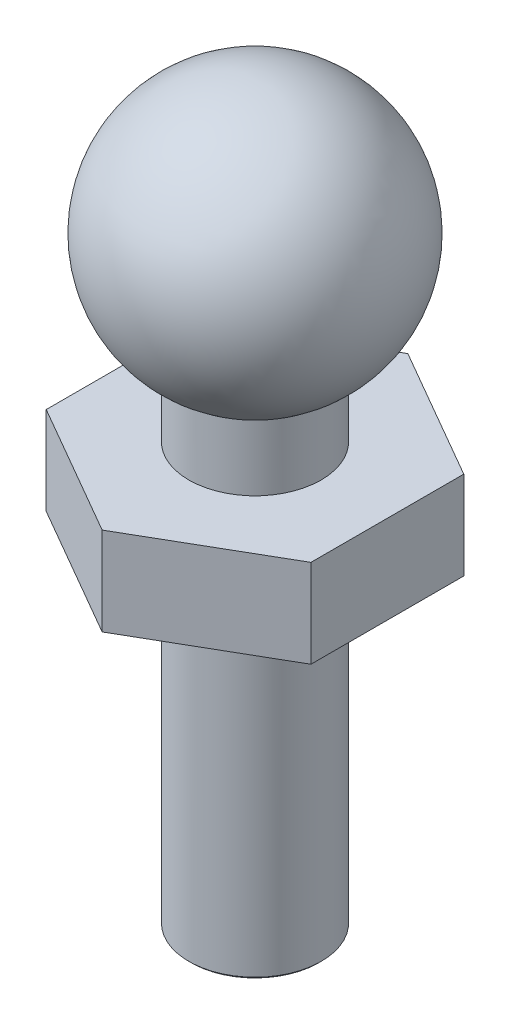
ISO-10303-21;
HEADER;
FILE_DESCRIPTION(('STEP AP214'),'2;1');
FILE_NAME('part.step','',(''),(''),'','','');
FILE_SCHEMA(('AUTOMOTIVE_DESIGN { 1 0 10303 214 1 1 1 1 }'));
ENDSEC;
DATA;
#1=APPLICATION_CONTEXT('core data for automotive mechanical design processes');
#2=APPLICATION_PROTOCOL_DEFINITION('international standard','automotive_design',2000,#1);
#3=PRODUCT_CONTEXT('',#1,'mechanical');
#4=PRODUCT('Part','Part','',(#3));
#5=PRODUCT_RELATED_PRODUCT_CATEGORY('part','',(#4));
#6=PRODUCT_DEFINITION_FORMATION('','',#4);
#7=PRODUCT_DEFINITION_CONTEXT('part definition',#1,'design');
#8=PRODUCT_DEFINITION('design','',#6,#7);
#9=PRODUCT_DEFINITION_SHAPE('','',#8);
#10=(LENGTH_UNIT() NAMED_UNIT(*) SI_UNIT(.MILLI.,.METRE.));
#11=(NAMED_UNIT(*) PLANE_ANGLE_UNIT() SI_UNIT($,.RADIAN.));
#12=(NAMED_UNIT(*) SI_UNIT($,.STERADIAN.) SOLID_ANGLE_UNIT());
#13=UNCERTAINTY_MEASURE_WITH_UNIT(LENGTH_MEASURE(1.E-05),#10,'distance_accuracy_value','');
#14=(GEOMETRIC_REPRESENTATION_CONTEXT(3) GLOBAL_UNCERTAINTY_ASSIGNED_CONTEXT((#13)) GLOBAL_UNIT_ASSIGNED_CONTEXT((#10,
#11,#12)) REPRESENTATION_CONTEXT('',''));
#15=CARTESIAN_POINT('',(0.,0.,0.));
#16=DIRECTION('',(0.,0.,1.));
#17=DIRECTION('',(1.,0.,0.));
#18=AXIS2_PLACEMENT_3D('',#15,#16,#17);
#19=CARTESIAN_POINT('',(0.,0.,0.));
#20=DIRECTION('',(0.,-1.,0.));
#21=DIRECTION('',(0.,0.,-1.));
#22=AXIS2_PLACEMENT_3D('',#19,#20,#21);
#23=CYLINDRICAL_SURFACE('',#22,1.5);
#24=CARTESIAN_POINT('',(0.,0.0500000000000012,0.));
#25=DIRECTION('',(0.,-1.,0.));
#26=DIRECTION('',(0.,0.,-1.));
#27=AXIS2_PLACEMENT_3D('',#24,#25,#26);
#28=CIRCLE('',#27,1.5);
#29=CARTESIAN_POINT('',(0.,0.0500000000000012,-1.5));
#30=VERTEX_POINT('',#29);
#31=EDGE_CURVE('E46',#30,#30,#28,.F.);
#32=ORIENTED_EDGE('',*,*,#31,.T.);
#33=EDGE_LOOP('',(#32));
#34=FACE_BOUND('',#33,.T.);
#35=CARTESIAN_POINT('',(0.,7.5,0.));
#36=DIRECTION('',(0.,1.,0.));
#37=DIRECTION('',(0.,0.,1.));
#38=AXIS2_PLACEMENT_3D('',#35,#36,#37);
#39=CIRCLE('',#38,1.5);
#40=CARTESIAN_POINT('',(0.,7.5,1.5));
#41=VERTEX_POINT('',#40);
#42=EDGE_CURVE('E128',#41,#41,#39,.T.);
#43=ORIENTED_EDGE('',*,*,#42,.F.);
#44=EDGE_LOOP('',(#43));
#45=FACE_BOUND('',#44,.T.);
#46=ADVANCED_FACE('F37',(#34,#45),#23,.T.);
#47=CARTESIAN_POINT('',(0.,0.,0.));
#48=DIRECTION('',(0.,-1.,0.));
#49=DIRECTION('',(0.,0.,-1.));
#50=AXIS2_PLACEMENT_3D('',#47,#48,#49);
#51=PLANE('',#50);
#52=CARTESIAN_POINT('',(0.,0.,0.));
#53=DIRECTION('',(0.,-1.,0.));
#54=DIRECTION('',(0.,0.,-1.));
#55=AXIS2_PLACEMENT_3D('',#52,#53,#54);
#56=CIRCLE('',#55,1.45);
#57=CARTESIAN_POINT('',(0.,0.,-1.45));
#58=VERTEX_POINT('',#57);
#59=EDGE_CURVE('E147',#58,#58,#56,.T.);
#60=ORIENTED_EDGE('',*,*,#59,.T.);
#61=EDGE_LOOP('',(#60));
#62=FACE_BOUND('',#61,.T.);
#63=ADVANCED_FACE('F156',(#62),#51,.T.);
#64=CARTESIAN_POINT('',(0.,0.,0.));
#65=DIRECTION('',(0.,1.,0.));
#66=DIRECTION('',(0.,0.,1.));
#67=AXIS2_PLACEMENT_3D('',#64,#65,#66);
#68=CONICAL_SURFACE('',#67,1.45,0.785398163397438);
#69=ORIENTED_EDGE('',*,*,#31,.F.);
#70=EDGE_LOOP('',(#69));
#71=FACE_BOUND('',#70,.T.);
#72=ORIENTED_EDGE('',*,*,#59,.F.);
#73=EDGE_LOOP('',(#72));
#74=FACE_BOUND('',#73,.T.);
#75=ADVANCED_FACE('F39',(#71,#74),#68,.T.);
#76=CARTESIAN_POINT('',(0.,9.5,0.));
#77=DIRECTION('',(0.,1.,0.));
#78=DIRECTION('',(0.,0.,1.));
#79=AXIS2_PLACEMENT_3D('',#76,#77,#78);
#80=PLANE('',#79);
#81=DIRECTION('',(0.,0.,-1.));
#82=VECTOR('',#81,1.);
#83=CARTESIAN_POINT('',(3.,9.5,1.73205080756886));
#84=LINE('',#83,#82);
#85=CARTESIAN_POINT('',(3.,9.5,1.73205080756886));
#86=VERTEX_POINT('',#85);
#87=CARTESIAN_POINT('',(2.99999999999999,9.5,-1.73205080756889));
#88=VERTEX_POINT('',#87);
#89=EDGE_CURVE('E135',#86,#88,#84,.T.);
#90=ORIENTED_EDGE('',*,*,#89,.T.);
#91=DIRECTION('',(-0.86602540378444,0.,-0.499999999999997));
#92=VECTOR('',#91,1.);
#93=CARTESIAN_POINT('',(2.99999999999999,9.5,-1.73205080756889));
#94=LINE('',#93,#92);
#95=CARTESIAN_POINT('',(0.,9.5,-3.46410161513775));
#96=VERTEX_POINT('',#95);
#97=EDGE_CURVE('E92',#88,#96,#94,.T.);
#98=ORIENTED_EDGE('',*,*,#97,.T.);
#99=DIRECTION('',(-0.866025403784437,0.,0.500000000000003));
#100=VECTOR('',#99,1.);
#101=CARTESIAN_POINT('',(0.,9.5,-3.46410161513775));
#102=LINE('',#101,#100);
#103=CARTESIAN_POINT('',(-3.,9.5,-1.73205080756887));
#104=VERTEX_POINT('',#103);
#105=EDGE_CURVE('E106',#96,#104,#102,.T.);
#106=ORIENTED_EDGE('',*,*,#105,.T.);
#107=DIRECTION('',(0.,0.,1.));
#108=VECTOR('',#107,1.);
#109=CARTESIAN_POINT('',(-3.,9.5,-1.73205080756887));
#110=LINE('',#109,#108);
#111=CARTESIAN_POINT('',(-2.99999999999999,9.5,1.73205080756889));
#112=VERTEX_POINT('',#111);
#113=EDGE_CURVE('E99',#104,#112,#110,.T.);
#114=ORIENTED_EDGE('',*,*,#113,.T.);
#115=DIRECTION('',(0.866025403784439,0.,0.5));
#116=VECTOR('',#115,1.);
#117=CARTESIAN_POINT('',(-2.99999999999999,9.5,1.73205080756889));
#118=LINE('',#117,#116);
#119=CARTESIAN_POINT('',(0.,9.5,3.46410161513776));
#120=VERTEX_POINT('',#119);
#121=EDGE_CURVE('E104',#112,#120,#118,.T.);
#122=ORIENTED_EDGE('',*,*,#121,.T.);
#123=DIRECTION('',(0.866025403784436,0.,-0.500000000000005));
#124=VECTOR('',#123,1.);
#125=CARTESIAN_POINT('',(0.,9.5,3.46410161513776));
#126=LINE('',#125,#124);
#127=EDGE_CURVE('E54',#120,#86,#126,.T.);
#128=ORIENTED_EDGE('',*,*,#127,.T.);
#129=EDGE_LOOP('',(#90,#98,#106,#114,#122,#128));
#130=FACE_BOUND('',#129,.T.);
#131=CARTESIAN_POINT('',(0.,9.5,0.));
#132=DIRECTION('',(0.,1.,0.));
#133=DIRECTION('',(0.,0.,1.));
#134=AXIS2_PLACEMENT_3D('',#131,#132,#133);
#135=CIRCLE('',#134,1.5);
#136=CARTESIAN_POINT('',(0.,9.5,1.5));
#137=VERTEX_POINT('',#136);
#138=EDGE_CURVE('E11',#137,#137,#135,.F.);
#139=ORIENTED_EDGE('',*,*,#138,.T.);
#140=EDGE_LOOP('',(#139));
#141=FACE_BOUND('',#140,.T.);
#142=ADVANCED_FACE('F101',(#130,#141),#80,.T.);
#143=CARTESIAN_POINT('',(0.,7.5,0.));
#144=DIRECTION('',(0.,1.,0.));
#145=DIRECTION('',(0.,0.,1.));
#146=AXIS2_PLACEMENT_3D('',#143,#144,#145);
#147=PLANE('',#146);
#148=DIRECTION('',(0.,0.,-1.));
#149=VECTOR('',#148,1.);
#150=CARTESIAN_POINT('',(3.,7.5,1.73205080756886));
#151=LINE('',#150,#149);
#152=CARTESIAN_POINT('',(3.,7.5,1.73205080756886));
#153=VERTEX_POINT('',#152);
#154=CARTESIAN_POINT('',(2.99999999999999,7.5,-1.73205080756889));
#155=VERTEX_POINT('',#154);
#156=EDGE_CURVE('E124',#153,#155,#151,.T.);
#157=ORIENTED_EDGE('',*,*,#156,.F.);
#158=DIRECTION('',(0.866025403784436,0.,-0.500000000000005));
#159=VECTOR('',#158,1.);
#160=CARTESIAN_POINT('',(0.,7.5,3.46410161513776));
#161=LINE('',#160,#159);
#162=CARTESIAN_POINT('',(0.,7.5,3.46410161513776));
#163=VERTEX_POINT('',#162);
#164=EDGE_CURVE('E83',#163,#153,#161,.T.);
#165=ORIENTED_EDGE('',*,*,#164,.F.);
#166=DIRECTION('',(0.866025403784439,0.,0.5));
#167=VECTOR('',#166,1.);
#168=CARTESIAN_POINT('',(-2.99999999999999,7.5,1.73205080756889));
#169=LINE('',#168,#167);
#170=CARTESIAN_POINT('',(-2.99999999999999,7.5,1.73205080756889));
#171=VERTEX_POINT('',#170);
#172=EDGE_CURVE('E77',#171,#163,#169,.T.);
#173=ORIENTED_EDGE('',*,*,#172,.F.);
#174=DIRECTION('',(0.,0.,1.));
#175=VECTOR('',#174,1.);
#176=CARTESIAN_POINT('',(-3.,7.5,-1.73205080756887));
#177=LINE('',#176,#175);
#178=CARTESIAN_POINT('',(-3.,7.5,-1.73205080756887));
#179=VERTEX_POINT('',#178);
#180=EDGE_CURVE('E114',#179,#171,#177,.T.);
#181=ORIENTED_EDGE('',*,*,#180,.F.);
#182=DIRECTION('',(-0.866025403784437,0.,0.500000000000003));
#183=VECTOR('',#182,1.);
#184=CARTESIAN_POINT('',(0.,7.5,-3.46410161513775));
#185=LINE('',#184,#183);
#186=CARTESIAN_POINT('',(0.,7.5,-3.46410161513775));
#187=VERTEX_POINT('',#186);
#188=EDGE_CURVE('E130',#187,#179,#185,.T.);
#189=ORIENTED_EDGE('',*,*,#188,.F.);
#190=DIRECTION('',(-0.86602540378444,0.,-0.499999999999997));
#191=VECTOR('',#190,1.);
#192=CARTESIAN_POINT('',(2.99999999999999,7.5,-1.73205080756889));
#193=LINE('',#192,#191);
#194=EDGE_CURVE('E127',#155,#187,#193,.T.);
#195=ORIENTED_EDGE('',*,*,#194,.F.);
#196=EDGE_LOOP('',(#157,#165,#173,#181,#189,#195));
#197=FACE_BOUND('',#196,.T.);
#198=ORIENTED_EDGE('',*,*,#42,.T.);
#199=EDGE_LOOP('',(#198));
#200=FACE_BOUND('',#199,.T.);
#201=ADVANCED_FACE('F186',(#197,#200),#147,.F.);
#202=CARTESIAN_POINT('',(3.,9.5,1.73205080756886));
#203=DIRECTION('',(-1.,0.,0.));
#204=DIRECTION('',(0.,0.,1.));
#205=AXIS2_PLACEMENT_3D('',#202,#203,#204);
#206=PLANE('',#205);
#207=ORIENTED_EDGE('',*,*,#156,.T.);
#208=DIRECTION('',(0.,-1.,0.));
#209=VECTOR('',#208,1.);
#210=CARTESIAN_POINT('',(2.99999999999999,9.5,-1.73205080756889));
#211=LINE('',#210,#209);
#212=EDGE_CURVE('E142',#88,#155,#211,.T.);
#213=ORIENTED_EDGE('',*,*,#212,.F.);
#214=ORIENTED_EDGE('',*,*,#89,.F.);
#215=DIRECTION('',(0.,-1.,0.));
#216=VECTOR('',#215,1.);
#217=CARTESIAN_POINT('',(3.,9.5,1.73205080756886));
#218=LINE('',#217,#216);
#219=EDGE_CURVE('E120',#86,#153,#218,.T.);
#220=ORIENTED_EDGE('',*,*,#219,.T.);
#221=EDGE_LOOP('',(#207,#213,#214,#220));
#222=FACE_BOUND('',#221,.T.);
#223=ADVANCED_FACE('F167',(#222),#206,.F.);
#224=CARTESIAN_POINT('',(2.99999999999999,9.5,-1.73205080756889));
#225=DIRECTION('',(-0.499999999999997,0.,0.86602540378444));
#226=DIRECTION('',(0.86602540378444,0.,0.499999999999997));
#227=AXIS2_PLACEMENT_3D('',#224,#225,#226);
#228=PLANE('',#227);
#229=ORIENTED_EDGE('',*,*,#194,.T.);
#230=DIRECTION('',(0.,-1.,0.));
#231=VECTOR('',#230,1.);
#232=CARTESIAN_POINT('',(0.,9.5,-3.46410161513775));
#233=LINE('',#232,#231);
#234=EDGE_CURVE('E139',#96,#187,#233,.T.);
#235=ORIENTED_EDGE('',*,*,#234,.F.);
#236=ORIENTED_EDGE('',*,*,#97,.F.);
#237=ORIENTED_EDGE('',*,*,#212,.T.);
#238=EDGE_LOOP('',(#229,#235,#236,#237));
#239=FACE_BOUND('',#238,.T.);
#240=ADVANCED_FACE('F193',(#239),#228,.F.);
#241=CARTESIAN_POINT('',(0.,9.5,-3.46410161513775));
#242=DIRECTION('',(0.500000000000003,0.,0.866025403784437));
#243=DIRECTION('',(0.866025403784437,0.,-0.500000000000003));
#244=AXIS2_PLACEMENT_3D('',#241,#242,#243);
#245=PLANE('',#244);
#246=ORIENTED_EDGE('',*,*,#188,.T.);
#247=DIRECTION('',(0.,-1.,0.));
#248=VECTOR('',#247,1.);
#249=CARTESIAN_POINT('',(-3.,9.5,-1.73205080756887));
#250=LINE('',#249,#248);
#251=EDGE_CURVE('E115',#104,#179,#250,.T.);
#252=ORIENTED_EDGE('',*,*,#251,.F.);
#253=ORIENTED_EDGE('',*,*,#105,.F.);
#254=ORIENTED_EDGE('',*,*,#234,.T.);
#255=EDGE_LOOP('',(#246,#252,#253,#254));
#256=FACE_BOUND('',#255,.T.);
#257=ADVANCED_FACE('F191',(#256),#245,.F.);
#258=CARTESIAN_POINT('',(-3.,9.5,-1.73205080756887));
#259=DIRECTION('',(1.,0.,0.));
#260=DIRECTION('',(0.,0.,-1.));
#261=AXIS2_PLACEMENT_3D('',#258,#259,#260);
#262=PLANE('',#261);
#263=ORIENTED_EDGE('',*,*,#180,.T.);
#264=DIRECTION('',(0.,-1.,0.));
#265=VECTOR('',#264,1.);
#266=CARTESIAN_POINT('',(-2.99999999999999,9.5,1.73205080756889));
#267=LINE('',#266,#265);
#268=EDGE_CURVE('E111',#112,#171,#267,.T.);
#269=ORIENTED_EDGE('',*,*,#268,.F.);
#270=ORIENTED_EDGE('',*,*,#113,.F.);
#271=ORIENTED_EDGE('',*,*,#251,.T.);
#272=EDGE_LOOP('',(#263,#269,#270,#271));
#273=FACE_BOUND('',#272,.T.);
#274=ADVANCED_FACE('F112',(#273),#262,.F.);
#275=CARTESIAN_POINT('',(-2.99999999999999,9.5,1.73205080756889));
#276=DIRECTION('',(0.499999999999999,0.,-0.866025403784439));
#277=DIRECTION('',(-0.866025403784439,0.,-0.5));
#278=AXIS2_PLACEMENT_3D('',#275,#276,#277);
#279=PLANE('',#278);
#280=ORIENTED_EDGE('',*,*,#172,.T.);
#281=DIRECTION('',(0.,-1.,0.));
#282=VECTOR('',#281,1.);
#283=CARTESIAN_POINT('',(0.,9.5,3.46410161513776));
#284=LINE('',#283,#282);
#285=EDGE_CURVE('E116',#120,#163,#284,.T.);
#286=ORIENTED_EDGE('',*,*,#285,.F.);
#287=ORIENTED_EDGE('',*,*,#121,.F.);
#288=ORIENTED_EDGE('',*,*,#268,.T.);
#289=EDGE_LOOP('',(#280,#286,#287,#288));
#290=FACE_BOUND('',#289,.T.);
#291=ADVANCED_FACE('F118',(#290),#279,.F.);
#292=CARTESIAN_POINT('',(0.,9.5,3.46410161513776));
#293=DIRECTION('',(-0.500000000000005,0.,-0.866025403784436));
#294=DIRECTION('',(-0.866025403784436,0.,0.500000000000005));
#295=AXIS2_PLACEMENT_3D('',#292,#293,#294);
#296=PLANE('',#295);
#297=ORIENTED_EDGE('',*,*,#164,.T.);
#298=ORIENTED_EDGE('',*,*,#219,.F.);
#299=ORIENTED_EDGE('',*,*,#127,.F.);
#300=ORIENTED_EDGE('',*,*,#285,.T.);
#301=EDGE_LOOP('',(#297,#298,#299,#300));
#302=FACE_BOUND('',#301,.T.);
#303=ADVANCED_FACE('F173',(#302),#296,.F.);
#304=CARTESIAN_POINT('',(0.,13.5980762113533,0.));
#305=DIRECTION('',(0.,-1.,0.));
#306=DIRECTION('',(1.,0.,0.));
#307=AXIS2_PLACEMENT_3D('',#304,#305,#306);
#308=SPHERICAL_SURFACE('',#307,3.);
#309=CARTESIAN_POINT('',(0.,11.,0.));
#310=DIRECTION('',(0.,-1.,0.));
#311=DIRECTION('',(0.,0.,-1.));
#312=AXIS2_PLACEMENT_3D('',#309,#310,#311);
#313=CIRCLE('',#312,1.5);
#314=CARTESIAN_POINT('',(0.,11.,-1.5));
#315=VERTEX_POINT('',#314);
#316=EDGE_CURVE('E144',#315,#315,#313,.T.);
#317=ORIENTED_EDGE('',*,*,#316,.F.);
#318=EDGE_LOOP('',(#317));
#319=FACE_BOUND('',#318,.T.);
#320=ADVANCED_FACE('F170',(#319),#308,.T.);
#321=ORIENTED_EDGE('',*,*,#138,.F.);
#322=EDGE_LOOP('',(#321));
#323=FACE_BOUND('',#322,.T.);
#324=ORIENTED_EDGE('',*,*,#316,.T.);
#325=EDGE_LOOP('',(#324));
#326=FACE_BOUND('',#325,.T.);
#327=ADVANCED_FACE('F165',(#323,#326),#23,.T.);
#328=CLOSED_SHELL('',(#46,#63,#75,#142,#201,#223,#240,#257,#274,#291,#303,#320,#327));
#329=MANIFOLD_SOLID_BREP('B2',#328);
#330=ADVANCED_BREP_SHAPE_REPRESENTATION('',(#18,#329),#14);
#331=SHAPE_DEFINITION_REPRESENTATION(#9,#330);
ENDSEC;
END-ISO-10303-21;
